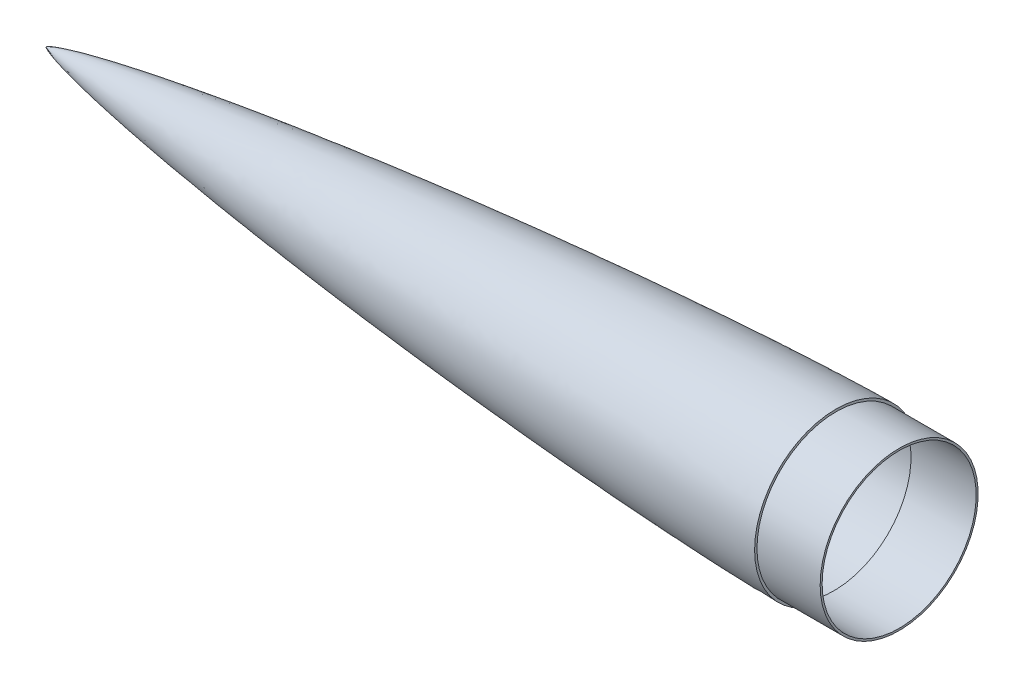
ISO-10303-21;
HEADER;
FILE_DESCRIPTION(('STEP AP214'),'2;1');
FILE_NAME('part.step','',(''),(''),'','','');
FILE_SCHEMA(('AUTOMOTIVE_DESIGN { 1 0 10303 214 1 1 1 1 }'));
ENDSEC;
DATA;
#1=APPLICATION_CONTEXT('core data for automotive mechanical design processes');
#2=APPLICATION_PROTOCOL_DEFINITION('international standard','automotive_design',2000,#1);
#3=PRODUCT_CONTEXT('',#1,'mechanical');
#4=PRODUCT('Part','Part','',(#3));
#5=PRODUCT_RELATED_PRODUCT_CATEGORY('part','',(#4));
#6=PRODUCT_DEFINITION_FORMATION('','',#4);
#7=PRODUCT_DEFINITION_CONTEXT('part definition',#1,'design');
#8=PRODUCT_DEFINITION('design','',#6,#7);
#9=PRODUCT_DEFINITION_SHAPE('','',#8);
#10=(LENGTH_UNIT() NAMED_UNIT(*) SI_UNIT(.MILLI.,.METRE.));
#11=(NAMED_UNIT(*) PLANE_ANGLE_UNIT() SI_UNIT($,.RADIAN.));
#12=(NAMED_UNIT(*) SI_UNIT($,.STERADIAN.) SOLID_ANGLE_UNIT());
#13=UNCERTAINTY_MEASURE_WITH_UNIT(LENGTH_MEASURE(1.E-05),#10,'distance_accuracy_value','');
#14=(GEOMETRIC_REPRESENTATION_CONTEXT(3) GLOBAL_UNCERTAINTY_ASSIGNED_CONTEXT((#13)) GLOBAL_UNIT_ASSIGNED_CONTEXT((#10,
#11,#12)) REPRESENTATION_CONTEXT('',''));
#15=CARTESIAN_POINT('',(0.,0.,0.));
#16=DIRECTION('',(0.,0.,1.));
#17=DIRECTION('',(1.,0.,0.));
#18=AXIS2_PLACEMENT_3D('',#15,#16,#17);
#19=CARTESIAN_POINT('',(635.,65.405,0.));
#20=CARTESIAN_POINT('',(632.980968041376,65.3999049079982,0.));
#21=CARTESIAN_POINT('',(628.943051518666,65.3607987649682,0.));
#22=CARTESIAN_POINT('',(620.867800743739,65.238425835158,0.));
#23=CARTESIAN_POINT('',(607.876612197197,64.9420444267635,0.));
#24=CARTESIAN_POINT('',(591.989866173885,64.4665825864284,0.));
#25=CARTESIAN_POINT('',(568.294487812533,63.5924578117391,0.));
#26=CARTESIAN_POINT('',(538.814064527861,62.2664605978091,0.));
#27=CARTESIAN_POINT('',(504.434100625351,60.4361863708921,0.));
#28=CARTESIAN_POINT('',(465.161890456531,58.0127528854532,0.));
#29=CARTESIAN_POINT('',(425.909385737502,55.2895252497301,0.));
#30=CARTESIAN_POINT('',(386.677550901074,52.2836135264071,0.));
#31=CARTESIAN_POINT('',(347.46776242828,49.0025673324941,0.));
#32=CARTESIAN_POINT('',(308.282068325667,45.4454012222465,0.));
#33=CARTESIAN_POINT('',(269.123174714222,41.6037605555624,0.));
#34=CARTESIAN_POINT('',(229.995170684784,37.4592339547084,0.));
#35=CARTESIAN_POINT('',(190.90356887878,32.9826992551564,0.));
#36=CARTESIAN_POINT('',(151.857530337521,28.1241973222402,0.));
#37=CARTESIAN_POINT('',(112.870807325211,22.8061369351955,0.));
#38=CARTESIAN_POINT('',(77.9573287846358,17.4873019784259,0.));
#39=CARTESIAN_POINT('',(49.1787935546804,12.5135793040533,0.));
#40=CARTESIAN_POINT('',(28.2617417770008,8.30499279351691,0.));
#41=CARTESIAN_POINT('',(16.0220282949449,5.44625020056791,0.));
#42=CARTESIAN_POINT('',(8.93318062814798,3.51548578780447,0.));
#43=CARTESIAN_POINT('',(5.16339541485639,2.32840347516785,0.));
#44=CARTESIAN_POINT('',(3.11582679923173,1.59218900684347,0.));
#45=CARTESIAN_POINT('',(1.97027691704133,1.1275016191836,0.));
#46=CARTESIAN_POINT('',(1.33181141167439,0.839140676757945,0.));
#47=CARTESIAN_POINT('',(0.95671602904962,0.653660621097922,0.));
#48=CARTESIAN_POINT('',(0.715531562152649,0.525146597932932,0.));
#49=CARTESIAN_POINT('',(0.550210431495335,0.431764809009291,0.));
#50=CARTESIAN_POINT('',(0.406270251751136,0.344359984283262,0.));
#51=CARTESIAN_POINT('',(0.283649615611126,0.263361482709997,0.));
#52=CARTESIAN_POINT('',(0.181602895816827,0.18888943286587,0.));
#53=CARTESIAN_POINT('',(0.109817079168359,0.130424863371353,0.));
#54=CARTESIAN_POINT('',(0.0569836765196351,0.0804262546774983,0.));
#55=CARTESIAN_POINT('',(0.0222716682134025,0.0403845586316774,0.));
#56=CARTESIAN_POINT('',(0.00752296936524731,0.0183675987536798,0.));
#57=CARTESIAN_POINT('',(0.00219211488346488,0.0062902080222314,0.));
#58=CARTESIAN_POINT('',(0.,0.,0.));
#59=B_SPLINE_CURVE_WITH_KNOTS('',4,(#19,#20,#21,#22,#23,#24,#25,#26,#27,#28,#29,#30,#31,#32,#33,
#34,#35,#36,#37,#38,#39,#40,#41,#42,#43,#44,#45,#46,#47,#48,#49,#50,#51,#52,#53,#54,#55,#56,#57,
#58),.UNSPECIFIED.,.F.,.F.,(5,1,1,1,1,1,1,1,1,1,1,1,1,1,1,1,1,1,1,1,1,1,1,1,1,1,1,1,1,1,1,1,1,1,
1,1,5),(0.,0.0126278600836156,0.0252557201672313,0.0505114403344626,0.0812725997628029,
0.112033759191143,0.173556078208551,0.235078396298971,0.296600715210933,0.358123034494872,
0.419645352372099,0.481167670690979,0.542689989321029,0.604212308113024,0.665734626856386,
0.727256945203041,0.788779262537685,0.850301578000527,0.911823895791277,0.948128969524394,
0.971421118017023,0.983729988096585,0.990421707276453,0.994070390445943,0.996134035175531,
0.997335608030765,0.998151497389768,0.998451073952135,0.998750650514502,0.999044750264593,
0.999338850014684,0.999504137511013,0.999669425007342,0.999834712503671,0.999917356251836,
0.999958678125918,1.),.UNSPECIFIED.);
#60=CARTESIAN_POINT('',(0.,0.,0.));
#61=DIRECTION('',(-1.,0.,0.));
#62=AXIS1_PLACEMENT('',#60,#61);
#63=SURFACE_OF_REVOLUTION('',#59,#62);
#64=CARTESIAN_POINT('',(0.,0.,0.));
#65=VERTEX_POINT('',#64);
#66=VERTEX_LOOP('',#65);
#67=FACE_BOUND('',#66,.T.);
#68=CARTESIAN_POINT('',(635.,0.,0.));
#69=DIRECTION('',(-1.,0.,0.));
#70=DIRECTION('',(0.,0.,1.));
#71=AXIS2_PLACEMENT_3D('',#68,#69,#70);
#72=CIRCLE('',#71,65.405);
#73=CARTESIAN_POINT('',(635.,0.,65.405));
#74=VERTEX_POINT('',#73);
#75=EDGE_CURVE('E79',#74,#74,#72,.T.);
#76=ORIENTED_EDGE('',*,*,#75,.T.);
#77=EDGE_LOOP('',(#76));
#78=FACE_BOUND('',#77,.T.);
#79=ADVANCED_FACE('F43',(#67,#78),#63,.T.);
#80=CARTESIAN_POINT('',(685.8,63.5,0.));
#81=DIRECTION('',(-1.,0.,0.));
#82=DIRECTION('',(0.,0.,1.));
#83=AXIS2_PLACEMENT_3D('',#80,#81,#82);
#84=PLANE('',#83);
#85=CARTESIAN_POINT('',(685.8,0.,0.));
#86=DIRECTION('',(-1.,0.,0.));
#87=DIRECTION('',(0.,0.,1.));
#88=AXIS2_PLACEMENT_3D('',#85,#86,#87);
#89=CIRCLE('',#88,61.9125);
#90=CARTESIAN_POINT('',(685.8,0.,61.9125));
#91=VERTEX_POINT('',#90);
#92=EDGE_CURVE('E73',#91,#91,#89,.T.);
#93=ORIENTED_EDGE('',*,*,#92,.T.);
#94=EDGE_LOOP('',(#93));
#95=FACE_BOUND('',#94,.T.);
#96=CARTESIAN_POINT('',(685.8,0.,0.));
#97=DIRECTION('',(-1.,0.,0.));
#98=DIRECTION('',(0.,0.,1.));
#99=AXIS2_PLACEMENT_3D('',#96,#97,#98);
#100=CIRCLE('',#99,63.5);
#101=CARTESIAN_POINT('',(685.8,0.,63.5));
#102=VERTEX_POINT('',#101);
#103=EDGE_CURVE('E11',#102,#102,#100,.T.);
#104=ORIENTED_EDGE('',*,*,#103,.F.);
#105=EDGE_LOOP('',(#104));
#106=FACE_BOUND('',#105,.T.);
#107=ADVANCED_FACE('F104',(#95,#106),#84,.F.);
#108=CARTESIAN_POINT('',(0.,0.,0.));
#109=DIRECTION('',(-1.,0.,0.));
#110=DIRECTION('',(0.,0.,1.));
#111=AXIS2_PLACEMENT_3D('',#108,#109,#110);
#112=CYLINDRICAL_SURFACE('',#111,63.5);
#113=CARTESIAN_POINT('',(635.,0.,0.));
#114=DIRECTION('',(-1.,0.,0.));
#115=DIRECTION('',(0.,0.,1.));
#116=AXIS2_PLACEMENT_3D('',#113,#114,#115);
#117=CIRCLE('',#116,63.5);
#118=CARTESIAN_POINT('',(635.,0.,63.5));
#119=VERTEX_POINT('',#118);
#120=EDGE_CURVE('E52',#119,#119,#117,.T.);
#121=ORIENTED_EDGE('',*,*,#120,.F.);
#122=EDGE_LOOP('',(#121));
#123=FACE_BOUND('',#122,.T.);
#124=ORIENTED_EDGE('',*,*,#103,.T.);
#125=EDGE_LOOP('',(#124));
#126=FACE_BOUND('',#125,.T.);
#127=ADVANCED_FACE('F101',(#123,#126),#112,.T.);
#128=CARTESIAN_POINT('',(635.,63.5,0.));
#129=DIRECTION('',(-1.,0.,0.));
#130=DIRECTION('',(0.,0.,1.));
#131=AXIS2_PLACEMENT_3D('',#128,#129,#130);
#132=PLANE('',#131);
#133=ORIENTED_EDGE('',*,*,#75,.F.);
#134=EDGE_LOOP('',(#133));
#135=FACE_BOUND('',#134,.T.);
#136=ORIENTED_EDGE('',*,*,#120,.T.);
#137=EDGE_LOOP('',(#136));
#138=FACE_BOUND('',#137,.T.);
#139=ADVANCED_FACE('F62',(#135,#138),#132,.F.);
#140=CARTESIAN_POINT('',(635.,65.405,0.));
#141=CARTESIAN_POINT('',(632.980968041376,65.3999049079982,0.));
#142=CARTESIAN_POINT('',(628.943051518666,65.3607987649682,0.));
#143=CARTESIAN_POINT('',(620.867800743739,65.238425835158,0.));
#144=CARTESIAN_POINT('',(607.876612197197,64.9420444267635,0.));
#145=CARTESIAN_POINT('',(591.989866173885,64.4665825864284,0.));
#146=CARTESIAN_POINT('',(568.294487812533,63.5924578117391,0.));
#147=CARTESIAN_POINT('',(538.814064527861,62.2664605978091,0.));
#148=CARTESIAN_POINT('',(504.434100625351,60.4361863708921,0.));
#149=CARTESIAN_POINT('',(465.161890456531,58.0127528854532,0.));
#150=CARTESIAN_POINT('',(425.909385737502,55.2895252497301,0.));
#151=CARTESIAN_POINT('',(386.677550901074,52.2836135264071,0.));
#152=CARTESIAN_POINT('',(347.46776242828,49.0025673324941,0.));
#153=CARTESIAN_POINT('',(308.282068325667,45.4454012222465,0.));
#154=CARTESIAN_POINT('',(269.123174714222,41.6037605555624,0.));
#155=CARTESIAN_POINT('',(229.995170684784,37.4592339547084,0.));
#156=CARTESIAN_POINT('',(190.90356887878,32.9826992551564,0.));
#157=CARTESIAN_POINT('',(151.857530337521,28.1241973222402,0.));
#158=CARTESIAN_POINT('',(112.870807325211,22.8061369351955,0.));
#159=CARTESIAN_POINT('',(77.9573287846358,17.4873019784259,0.));
#160=CARTESIAN_POINT('',(49.1787935546804,12.5135793040533,0.));
#161=CARTESIAN_POINT('',(28.2617417770008,8.30499279351691,0.));
#162=CARTESIAN_POINT('',(16.0220282949449,5.44625020056791,0.));
#163=CARTESIAN_POINT('',(8.93318062814798,3.51548578780447,0.));
#164=CARTESIAN_POINT('',(5.34723088355805,2.386292140167,0.));
#165=CARTESIAN_POINT('',(3.6596293922744,1.78691850190998,0.));
#166=CARTESIAN_POINT('',(2.98645416155403,1.52966839929743,0.));
#167=CARTESIAN_POINT('',(2.85848234221888,1.48002014769658,0.));
#168=B_SPLINE_CURVE_WITH_KNOTS('',4,(#140,#141,#142,#143,#144,#145,#146,#147,#148,#149,#150,
#151,#152,#153,#154,#155,#156,#157,#158,#159,#160,#161,#162,#163,#164,#165,#166,#167),
.UNSPECIFIED.,.F.,.F.,(5,1,1,1,1,1,1,1,1,1,1,1,1,1,1,1,1,1,1,1,1,1,1,1,5),(0.,
0.0126278600836156,0.0252557201672313,0.0505114403344626,0.0812725997628029,0.112033759191143,
0.173556078208551,0.235078396298971,0.296600715210933,0.358123034494872,0.419645352372099,
0.481167670690979,0.542689989321029,0.604212308113024,0.665734626856386,0.727256945203041,
0.788779262537685,0.850301578000527,0.911823895791277,0.948128969524394,0.971421118017023,
0.983729988096585,0.990421707276453,0.994070390445943,0.994928897362161),.UNSPECIFIED.);
#169=CARTESIAN_POINT('',(0.,0.,0.));
#170=DIRECTION('',(-1.,0.,0.));
#171=AXIS1_PLACEMENT('',#169,#170);
#172=SURFACE_OF_REVOLUTION('',#168,#171);
#173=OFFSET_SURFACE('',#172,-1.5875,.F.);
#174=CARTESIAN_POINT('',(3.43267448115157,0.,0.));
#175=VERTEX_POINT('',#174);
#176=VERTEX_LOOP('',#175);
#177=FACE_BOUND('',#176,.T.);
#178=CARTESIAN_POINT('',(633.4125,0.,0.));
#179=DIRECTION('',(-1.,0.,0.));
#180=DIRECTION('',(0.,0.,1.));
#181=AXIS2_PLACEMENT_3D('',#178,#179,#180);
#182=CIRCLE('',#181,63.8103701539512);
#183=CARTESIAN_POINT('',(633.4125,0.,63.8103701539512));
#184=VERTEX_POINT('',#183);
#185=EDGE_CURVE('E66',#184,#184,#182,.T.);
#186=ORIENTED_EDGE('',*,*,#185,.F.);
#187=EDGE_LOOP('',(#186));
#188=FACE_BOUND('',#187,.T.);
#189=ADVANCED_FACE('F58',(#177,#188),#173,.F.);
#190=CARTESIAN_POINT('',(0.,0.,0.));
#191=DIRECTION('',(-1.,0.,0.));
#192=DIRECTION('',(0.,0.,1.));
#193=AXIS2_PLACEMENT_3D('',#190,#191,#192);
#194=CYLINDRICAL_SURFACE('',#193,61.9125);
#195=CARTESIAN_POINT('',(633.4125,0.,0.));
#196=DIRECTION('',(-1.,0.,0.));
#197=DIRECTION('',(0.,0.,1.));
#198=AXIS2_PLACEMENT_3D('',#195,#196,#197);
#199=CIRCLE('',#198,61.9125);
#200=CARTESIAN_POINT('',(633.4125,0.,61.9125));
#201=VERTEX_POINT('',#200);
#202=EDGE_CURVE('E69',#201,#201,#199,.T.);
#203=ORIENTED_EDGE('',*,*,#202,.T.);
#204=EDGE_LOOP('',(#203));
#205=FACE_BOUND('',#204,.T.);
#206=ORIENTED_EDGE('',*,*,#92,.F.);
#207=EDGE_LOOP('',(#206));
#208=FACE_BOUND('',#207,.T.);
#209=ADVANCED_FACE('F61',(#205,#208),#194,.F.);
#210=CARTESIAN_POINT('',(633.4125,63.5,0.));
#211=DIRECTION('',(-1.,0.,0.));
#212=DIRECTION('',(0.,0.,1.));
#213=AXIS2_PLACEMENT_3D('',#210,#211,#212);
#214=PLANE('',#213);
#215=ORIENTED_EDGE('',*,*,#185,.T.);
#216=EDGE_LOOP('',(#215));
#217=FACE_BOUND('',#216,.T.);
#218=ORIENTED_EDGE('',*,*,#202,.F.);
#219=EDGE_LOOP('',(#218));
#220=FACE_BOUND('',#219,.T.);
#221=ADVANCED_FACE('F95',(#217,#220),#214,.T.);
#222=CLOSED_SHELL('',(#79,#107,#127,#139,#189,#209,#221));
#223=MANIFOLD_SOLID_BREP('B2',#222);
#224=ADVANCED_BREP_SHAPE_REPRESENTATION('',(#18,#223),#14);
#225=SHAPE_DEFINITION_REPRESENTATION(#9,#224);
ENDSEC;
END-ISO-10303-21;
